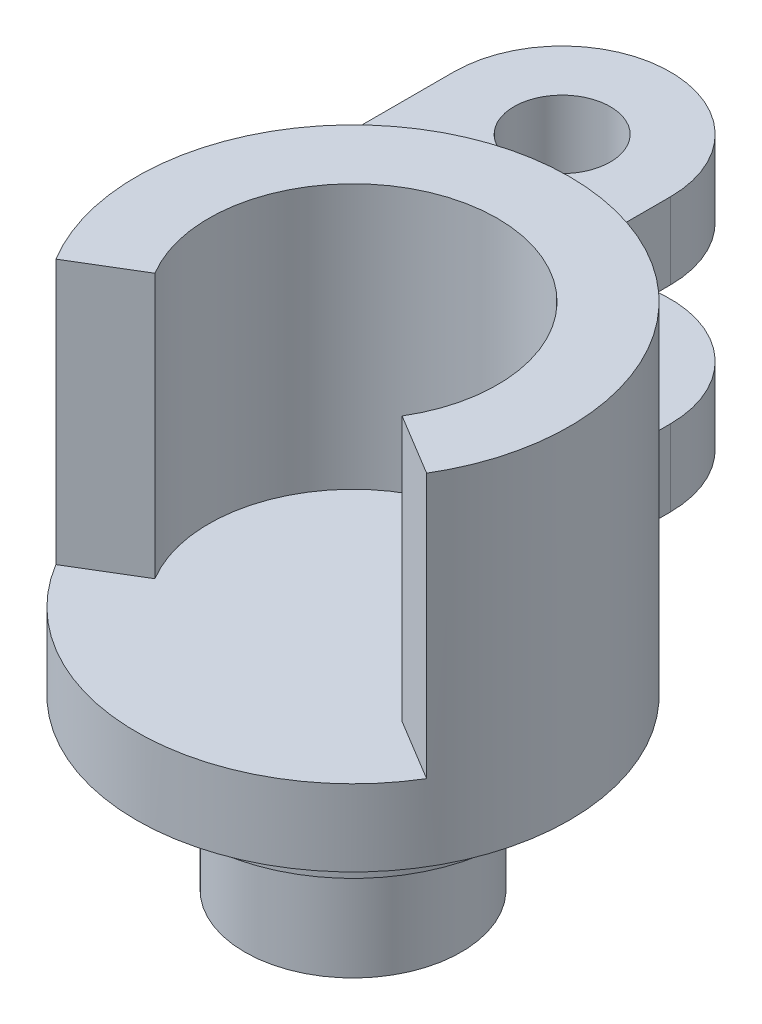
ISO-10303-21;
HEADER;
FILE_DESCRIPTION(('STEP AP214'),'2;1');
FILE_NAME('part.step','',(''),(''),'','','');
FILE_SCHEMA(('AUTOMOTIVE_DESIGN { 1 0 10303 214 1 1 1 1 }'));
ENDSEC;
DATA;
#1=APPLICATION_CONTEXT('core data for automotive mechanical design processes');
#2=APPLICATION_PROTOCOL_DEFINITION('international standard','automotive_design',2000,#1);
#3=PRODUCT_CONTEXT('',#1,'mechanical');
#4=PRODUCT('Part','Part','',(#3));
#5=PRODUCT_RELATED_PRODUCT_CATEGORY('part','',(#4));
#6=PRODUCT_DEFINITION_FORMATION('','',#4);
#7=PRODUCT_DEFINITION_CONTEXT('part definition',#1,'design');
#8=PRODUCT_DEFINITION('design','',#6,#7);
#9=PRODUCT_DEFINITION_SHAPE('','',#8);
#10=(LENGTH_UNIT() NAMED_UNIT(*) SI_UNIT(.MILLI.,.METRE.));
#11=(NAMED_UNIT(*) PLANE_ANGLE_UNIT() SI_UNIT($,.RADIAN.));
#12=(NAMED_UNIT(*) SI_UNIT($,.STERADIAN.) SOLID_ANGLE_UNIT());
#13=UNCERTAINTY_MEASURE_WITH_UNIT(LENGTH_MEASURE(1.E-05),#10,'distance_accuracy_value','');
#14=(GEOMETRIC_REPRESENTATION_CONTEXT(3) GLOBAL_UNCERTAINTY_ASSIGNED_CONTEXT((#13)) GLOBAL_UNIT_ASSIGNED_CONTEXT((#10,
#11,#12)) REPRESENTATION_CONTEXT('',''));
#15=CARTESIAN_POINT('',(0.,0.,0.));
#16=DIRECTION('',(0.,0.,1.));
#17=DIRECTION('',(1.,0.,0.));
#18=AXIS2_PLACEMENT_3D('',#15,#16,#17);
#19=CARTESIAN_POINT('',(0.,3.175,0.));
#20=DIRECTION('',(0.,-1.,0.));
#21=DIRECTION('',(0.,0.,-1.));
#22=AXIS2_PLACEMENT_3D('',#19,#20,#21);
#23=CYLINDRICAL_SURFACE('',#22,9.);
#24=DIRECTION('',(0.,-1.,0.));
#25=VECTOR('',#24,1.);
#26=CARTESIAN_POINT('',(0.,11.349999906,-9.));
#27=LINE('',#26,#25);
#28=CARTESIAN_POINT('',(0.,11.349999906,-9.));
#29=VERTEX_POINT('',#28);
#30=CARTESIAN_POINT('',(0.,8.174999906,-9.));
#31=VERTEX_POINT('',#30);
#32=EDGE_CURVE('E59',#29,#31,#27,.T.);
#33=ORIENTED_EDGE('',*,*,#32,.F.);
#34=CARTESIAN_POINT('',(0.,11.349999906,0.));
#35=DIRECTION('',(0.,-1.,0.));
#36=DIRECTION('',(0.,0.,1.));
#37=AXIS2_PLACEMENT_3D('',#34,#35,#36);
#38=CIRCLE('',#37,9.);
#39=CARTESIAN_POINT('',(-9.,11.349999906,0.));
#40=VERTEX_POINT('',#39);
#41=EDGE_CURVE('E64',#40,#29,#38,.T.);
#42=ORIENTED_EDGE('',*,*,#41,.F.);
#43=DIRECTION('',(0.,-1.,0.));
#44=VECTOR('',#43,1.);
#45=CARTESIAN_POINT('',(-9.,11.349999906,0.));
#46=LINE('',#45,#44);
#47=CARTESIAN_POINT('',(-9.,8.174999906,0.));
#48=VERTEX_POINT('',#47);
#49=EDGE_CURVE('E156',#40,#48,#46,.T.);
#50=ORIENTED_EDGE('',*,*,#49,.T.);
#51=CARTESIAN_POINT('',(0.,8.174999906,0.));
#52=DIRECTION('',(0.,-1.,0.));
#53=DIRECTION('',(0.,0.,1.));
#54=AXIS2_PLACEMENT_3D('',#51,#52,#53);
#55=CIRCLE('',#54,9.);
#56=EDGE_CURVE('E160',#48,#31,#55,.T.);
#57=ORIENTED_EDGE('',*,*,#56,.T.);
#58=EDGE_LOOP('',(#33,#42,#50,#57));
#59=FACE_BOUND('',#58,.T.);
#60=CARTESIAN_POINT('',(0.,3.175,0.));
#61=DIRECTION('',(0.,1.,0.));
#62=DIRECTION('',(0.,0.,1.));
#63=AXIS2_PLACEMENT_3D('',#60,#61,#62);
#64=CIRCLE('',#63,9.);
#65=CARTESIAN_POINT('',(-7.70770438364841,3.175,4.64664321142554));
#66=VERTEX_POINT('',#65);
#67=CARTESIAN_POINT('',(7.70770438364841,3.175,4.64664321142554));
#68=VERTEX_POINT('',#67);
#69=EDGE_CURVE('E233',#66,#68,#64,.T.);
#70=ORIENTED_EDGE('',*,*,#69,.F.);
#71=DIRECTION('',(0.,-1.,0.));
#72=VECTOR('',#71,1.);
#73=CARTESIAN_POINT('',(-7.70770438364841,14.175,4.64664321142554));
#74=LINE('',#73,#72);
#75=CARTESIAN_POINT('',(-7.70770438364841,14.175,4.64664321142554));
#76=VERTEX_POINT('',#75);
#77=EDGE_CURVE('E270',#76,#66,#74,.T.);
#78=ORIENTED_EDGE('',*,*,#77,.F.);
#79=CARTESIAN_POINT('',(0.,14.175,0.));
#80=DIRECTION('',(0.,1.,0.));
#81=DIRECTION('',(0.,0.,-1.));
#82=AXIS2_PLACEMENT_3D('',#79,#80,#81);
#83=CIRCLE('',#82,9.);
#84=CARTESIAN_POINT('',(7.70770438364841,14.175,4.64664321142554));
#85=VERTEX_POINT('',#84);
#86=EDGE_CURVE('E234',#85,#76,#83,.T.);
#87=ORIENTED_EDGE('',*,*,#86,.F.);
#88=DIRECTION('',(0.,-1.,0.));
#89=VECTOR('',#88,1.);
#90=CARTESIAN_POINT('',(7.70770438364841,14.175,4.64664321142554));
#91=LINE('',#90,#89);
#92=EDGE_CURVE('E248',#85,#68,#91,.T.);
#93=ORIENTED_EDGE('',*,*,#92,.T.);
#94=EDGE_LOOP('',(#70,#78,#87,#93));
#95=FACE_BOUND('',#94,.T.);
#96=DIRECTION('',(0.,-1.,0.));
#97=VECTOR('',#96,1.);
#98=CARTESIAN_POINT('',(0.,23.0265647372949,-9.));
#99=LINE('',#98,#97);
#100=CARTESIAN_POINT('',(0.,3.175,-9.));
#101=VERTEX_POINT('',#100);
#102=CARTESIAN_POINT('',(0.,0.,-9.));
#103=VERTEX_POINT('',#102);
#104=EDGE_CURVE('E195',#101,#103,#99,.T.);
#105=ORIENTED_EDGE('',*,*,#104,.F.);
#106=CARTESIAN_POINT('',(0.,3.175,0.));
#107=DIRECTION('',(0.,1.,0.));
#108=DIRECTION('',(0.,0.,1.));
#109=AXIS2_PLACEMENT_3D('',#106,#107,#108);
#110=CIRCLE('',#109,9.);
#111=CARTESIAN_POINT('',(-9.,3.175,0.));
#112=VERTEX_POINT('',#111);
#113=EDGE_CURVE('E205',#112,#101,#110,.F.);
#114=ORIENTED_EDGE('',*,*,#113,.F.);
#115=DIRECTION('',(0.,-1.,0.));
#116=VECTOR('',#115,1.);
#117=CARTESIAN_POINT('',(-9.,23.0265647372949,0.));
#118=LINE('',#117,#116);
#119=CARTESIAN_POINT('',(-9.,0.,0.));
#120=VERTEX_POINT('',#119);
#121=EDGE_CURVE('E179',#112,#120,#118,.T.);
#122=ORIENTED_EDGE('',*,*,#121,.T.);
#123=CARTESIAN_POINT('',(0.,0.,0.));
#124=DIRECTION('',(0.,1.,0.));
#125=DIRECTION('',(0.,0.,1.));
#126=AXIS2_PLACEMENT_3D('',#123,#124,#125);
#127=CIRCLE('',#126,9.);
#128=EDGE_CURVE('E274',#120,#103,#127,.T.);
#129=ORIENTED_EDGE('',*,*,#128,.T.);
#130=EDGE_LOOP('',(#105,#114,#122,#129));
#131=FACE_BOUND('',#130,.T.);
#132=ADVANCED_FACE('F42',(#59,#95,#131),#23,.T.);
#133=CARTESIAN_POINT('',(0.,3.175,0.));
#134=DIRECTION('',(0.,1.,0.));
#135=DIRECTION('',(0.,0.,1.));
#136=AXIS2_PLACEMENT_3D('',#133,#134,#135);
#137=PLANE('',#136);
#138=DIRECTION('',(0.856411598183157,0.,0.516293690158394));
#139=VECTOR('',#138,1.);
#140=CARTESIAN_POINT('',(5.13846958909894,3.175,3.09776214095036));
#141=LINE('',#140,#139);
#142=CARTESIAN_POINT('',(5.13846958909894,3.175,3.09776214095036));
#143=VERTEX_POINT('',#142);
#144=EDGE_CURVE('E239',#143,#68,#141,.T.);
#145=ORIENTED_EDGE('',*,*,#144,.F.);
#146=CARTESIAN_POINT('',(0.,3.175,0.));
#147=DIRECTION('',(0.,-1.,0.));
#148=DIRECTION('',(0.,0.,-1.));
#149=AXIS2_PLACEMENT_3D('',#146,#147,#148);
#150=CIRCLE('',#149,6.);
#151=CARTESIAN_POINT('',(-5.13846958909894,3.175,3.09776214095036));
#152=VERTEX_POINT('',#151);
#153=EDGE_CURVE('E252',#152,#143,#150,.T.);
#154=ORIENTED_EDGE('',*,*,#153,.F.);
#155=DIRECTION('',(0.856411598183157,0.,-0.516293690158393));
#156=VECTOR('',#155,1.);
#157=CARTESIAN_POINT('',(-7.70770438364841,3.175,4.64664321142554));
#158=LINE('',#157,#156);
#159=EDGE_CURVE('E229',#66,#152,#158,.T.);
#160=ORIENTED_EDGE('',*,*,#159,.F.);
#161=ORIENTED_EDGE('',*,*,#69,.T.);
#162=EDGE_LOOP('',(#145,#154,#160,#161));
#163=FACE_BOUND('',#162,.T.);
#164=ADVANCED_FACE('F307',(#163),#137,.T.);
#165=CARTESIAN_POINT('',(0.,0.,0.));
#166=DIRECTION('',(0.,1.,0.));
#167=DIRECTION('',(0.,0.,1.));
#168=AXIS2_PLACEMENT_3D('',#165,#166,#167);
#169=PLANE('',#168);
#170=CARTESIAN_POINT('',(-4.5,0.,-13.1941974251168));
#171=DIRECTION('',(0.,1.,0.));
#172=DIRECTION('',(0.,0.,1.));
#173=AXIS2_PLACEMENT_3D('',#170,#171,#172);
#174=CIRCLE('',#173,2.);
#175=CARTESIAN_POINT('',(-4.5,0.,-11.1941974251168));
#176=VERTEX_POINT('',#175);
#177=EDGE_CURVE('E348',#176,#176,#174,.F.);
#178=ORIENTED_EDGE('',*,*,#177,.F.);
#179=EDGE_LOOP('',(#178));
#180=FACE_BOUND('',#179,.T.);
#181=CARTESIAN_POINT('',(0.,0.,0.));
#182=DIRECTION('',(0.,-1.,0.));
#183=DIRECTION('',(0.,0.,-1.));
#184=AXIS2_PLACEMENT_3D('',#181,#182,#183);
#185=CIRCLE('',#184,6.5);
#186=CARTESIAN_POINT('',(0.,0.,-6.5));
#187=VERTEX_POINT('',#186);
#188=EDGE_CURVE('E51',#187,#187,#185,.T.);
#189=ORIENTED_EDGE('',*,*,#188,.F.);
#190=EDGE_LOOP('',(#189));
#191=FACE_BOUND('',#190,.T.);
#192=ORIENTED_EDGE('',*,*,#128,.F.);
#193=DIRECTION('',(0.,0.,1.));
#194=VECTOR('',#193,1.);
#195=CARTESIAN_POINT('',(-9.,0.,0.));
#196=LINE('',#195,#194);
#197=CARTESIAN_POINT('',(-9.,0.,-13.1941974251168));
#198=VERTEX_POINT('',#197);
#199=EDGE_CURVE('E180',#198,#120,#196,.T.);
#200=ORIENTED_EDGE('',*,*,#199,.F.);
#201=CARTESIAN_POINT('',(-4.5,0.,-13.1941974251168));
#202=DIRECTION('',(0.,1.,0.));
#203=DIRECTION('',(0.,0.,1.));
#204=AXIS2_PLACEMENT_3D('',#201,#202,#203);
#205=CIRCLE('',#204,4.5);
#206=CARTESIAN_POINT('',(0.,0.,-13.1941974251168));
#207=VERTEX_POINT('',#206);
#208=EDGE_CURVE('E186',#207,#198,#205,.T.);
#209=ORIENTED_EDGE('',*,*,#208,.F.);
#210=DIRECTION('',(0.,0.,-1.));
#211=VECTOR('',#210,1.);
#212=CARTESIAN_POINT('',(0.,0.,-9.));
#213=LINE('',#212,#211);
#214=EDGE_CURVE('E191',#103,#207,#213,.T.);
#215=ORIENTED_EDGE('',*,*,#214,.F.);
#216=EDGE_LOOP('',(#192,#200,#209,#215));
#217=FACE_BOUND('',#216,.T.);
#218=ADVANCED_FACE('F287',(#180,#191,#217),#169,.F.);
#219=CARTESIAN_POINT('',(-7.70770438364841,14.175,4.64664321142554));
#220=DIRECTION('',(-0.516293690158393,0.,-0.856411598183157));
#221=DIRECTION('',(-0.856411598183157,0.,0.516293690158393));
#222=AXIS2_PLACEMENT_3D('',#219,#220,#221);
#223=PLANE('',#222);
#224=ORIENTED_EDGE('',*,*,#159,.T.);
#225=DIRECTION('',(0.,-1.,0.));
#226=VECTOR('',#225,1.);
#227=CARTESIAN_POINT('',(-5.13846958909894,14.175,3.09776214095036));
#228=LINE('',#227,#226);
#229=CARTESIAN_POINT('',(-5.13846958909894,14.175,3.09776214095036));
#230=VERTEX_POINT('',#229);
#231=EDGE_CURVE('E266',#230,#152,#228,.T.);
#232=ORIENTED_EDGE('',*,*,#231,.F.);
#233=DIRECTION('',(0.856411598183157,0.,-0.516293690158393));
#234=VECTOR('',#233,1.);
#235=CARTESIAN_POINT('',(-7.70770438364841,14.175,4.64664321142554));
#236=LINE('',#235,#234);
#237=EDGE_CURVE('E238',#76,#230,#236,.T.);
#238=ORIENTED_EDGE('',*,*,#237,.F.);
#239=ORIENTED_EDGE('',*,*,#77,.T.);
#240=EDGE_LOOP('',(#224,#232,#238,#239));
#241=FACE_BOUND('',#240,.T.);
#242=ADVANCED_FACE('F320',(#241),#223,.F.);
#243=CARTESIAN_POINT('',(0.,14.175,0.));
#244=DIRECTION('',(0.,-1.,0.));
#245=DIRECTION('',(0.,0.,-1.));
#246=AXIS2_PLACEMENT_3D('',#243,#244,#245);
#247=CYLINDRICAL_SURFACE('',#246,6.);
#248=ORIENTED_EDGE('',*,*,#153,.T.);
#249=DIRECTION('',(0.,-1.,0.));
#250=VECTOR('',#249,1.);
#251=CARTESIAN_POINT('',(5.13846958909894,14.175,3.09776214095036));
#252=LINE('',#251,#250);
#253=CARTESIAN_POINT('',(5.13846958909894,14.175,3.09776214095036));
#254=VERTEX_POINT('',#253);
#255=EDGE_CURVE('E262',#254,#143,#252,.T.);
#256=ORIENTED_EDGE('',*,*,#255,.F.);
#257=CARTESIAN_POINT('',(0.,14.175,0.));
#258=DIRECTION('',(0.,-1.,0.));
#259=DIRECTION('',(0.,0.,-1.));
#260=AXIS2_PLACEMENT_3D('',#257,#258,#259);
#261=CIRCLE('',#260,6.);
#262=EDGE_CURVE('E242',#230,#254,#261,.T.);
#263=ORIENTED_EDGE('',*,*,#262,.F.);
#264=ORIENTED_EDGE('',*,*,#231,.T.);
#265=EDGE_LOOP('',(#248,#256,#263,#264));
#266=FACE_BOUND('',#265,.T.);
#267=ADVANCED_FACE('F330',(#266),#247,.F.);
#268=CARTESIAN_POINT('',(5.13846958909894,14.175,3.09776214095036));
#269=DIRECTION('',(0.516293690158394,0.,-0.856411598183157));
#270=DIRECTION('',(-0.856411598183157,0.,-0.516293690158394));
#271=AXIS2_PLACEMENT_3D('',#268,#269,#270);
#272=PLANE('',#271);
#273=ORIENTED_EDGE('',*,*,#144,.T.);
#274=ORIENTED_EDGE('',*,*,#92,.F.);
#275=DIRECTION('',(0.856411598183157,0.,0.516293690158394));
#276=VECTOR('',#275,1.);
#277=CARTESIAN_POINT('',(5.13846958909894,14.175,3.09776214095036));
#278=LINE('',#277,#276);
#279=EDGE_CURVE('E245',#254,#85,#278,.T.);
#280=ORIENTED_EDGE('',*,*,#279,.F.);
#281=ORIENTED_EDGE('',*,*,#255,.T.);
#282=EDGE_LOOP('',(#273,#274,#280,#281));
#283=FACE_BOUND('',#282,.T.);
#284=ADVANCED_FACE('F328',(#283),#272,.F.);
#285=CARTESIAN_POINT('',(0.,14.175,0.));
#286=DIRECTION('',(0.,-1.,0.));
#287=DIRECTION('',(0.,0.,-1.));
#288=AXIS2_PLACEMENT_3D('',#285,#286,#287);
#289=PLANE('',#288);
#290=ORIENTED_EDGE('',*,*,#86,.T.);
#291=ORIENTED_EDGE('',*,*,#237,.T.);
#292=ORIENTED_EDGE('',*,*,#262,.T.);
#293=ORIENTED_EDGE('',*,*,#279,.T.);
#294=EDGE_LOOP('',(#290,#291,#292,#293));
#295=FACE_BOUND('',#294,.T.);
#296=ADVANCED_FACE('F324',(#295),#289,.F.);
#297=CARTESIAN_POINT('',(0.,-2.,0.));
#298=DIRECTION('',(0.,1.,0.));
#299=DIRECTION('',(0.,0.,1.));
#300=AXIS2_PLACEMENT_3D('',#297,#298,#299);
#301=CYLINDRICAL_SURFACE('',#300,6.5);
#302=CARTESIAN_POINT('',(0.,-2.,0.));
#303=DIRECTION('',(0.,-1.,0.));
#304=DIRECTION('',(0.,0.,-1.));
#305=AXIS2_PLACEMENT_3D('',#302,#303,#304);
#306=CIRCLE('',#305,6.5);
#307=CARTESIAN_POINT('',(0.,-2.,-6.5));
#308=VERTEX_POINT('',#307);
#309=EDGE_CURVE('E224',#308,#308,#306,.T.);
#310=ORIENTED_EDGE('',*,*,#309,.F.);
#311=EDGE_LOOP('',(#310));
#312=FACE_BOUND('',#311,.T.);
#313=ORIENTED_EDGE('',*,*,#188,.T.);
#314=EDGE_LOOP('',(#313));
#315=FACE_BOUND('',#314,.T.);
#316=ADVANCED_FACE('F351',(#312,#315),#301,.T.);
#317=CARTESIAN_POINT('',(0.,-2.,0.));
#318=DIRECTION('',(0.,-1.,0.));
#319=DIRECTION('',(0.,0.,-1.));
#320=AXIS2_PLACEMENT_3D('',#317,#318,#319);
#321=PLANE('',#320);
#322=CARTESIAN_POINT('',(0.,-2.,0.));
#323=DIRECTION('',(0.,-1.,0.));
#324=DIRECTION('',(0.,0.,-1.));
#325=AXIS2_PLACEMENT_3D('',#322,#323,#324);
#326=CIRCLE('',#325,4.5);
#327=CARTESIAN_POINT('',(0.,-2.,-4.5));
#328=VERTEX_POINT('',#327);
#329=EDGE_CURVE('E11',#328,#328,#326,.T.);
#330=ORIENTED_EDGE('',*,*,#329,.F.);
#331=EDGE_LOOP('',(#330));
#332=FACE_BOUND('',#331,.T.);
#333=ORIENTED_EDGE('',*,*,#309,.T.);
#334=EDGE_LOOP('',(#333));
#335=FACE_BOUND('',#334,.T.);
#336=ADVANCED_FACE('F353',(#332,#335),#321,.T.);
#337=CARTESIAN_POINT('',(0.,-7.,0.));
#338=DIRECTION('',(0.,1.,0.));
#339=DIRECTION('',(0.,0.,1.));
#340=AXIS2_PLACEMENT_3D('',#337,#338,#339);
#341=CYLINDRICAL_SURFACE('',#340,4.5);
#342=CARTESIAN_POINT('',(0.,-7.,0.));
#343=DIRECTION('',(0.,-1.,0.));
#344=DIRECTION('',(0.,0.,-1.));
#345=AXIS2_PLACEMENT_3D('',#342,#343,#344);
#346=CIRCLE('',#345,4.5);
#347=CARTESIAN_POINT('',(0.,-7.,-4.5));
#348=VERTEX_POINT('',#347);
#349=EDGE_CURVE('E200',#348,#348,#346,.T.);
#350=ORIENTED_EDGE('',*,*,#349,.F.);
#351=EDGE_LOOP('',(#350));
#352=FACE_BOUND('',#351,.T.);
#353=ORIENTED_EDGE('',*,*,#329,.T.);
#354=EDGE_LOOP('',(#353));
#355=FACE_BOUND('',#354,.T.);
#356=ADVANCED_FACE('F360',(#352,#355),#341,.T.);
#357=CARTESIAN_POINT('',(0.,-7.,0.));
#358=DIRECTION('',(0.,-1.,0.));
#359=DIRECTION('',(0.,0.,-1.));
#360=AXIS2_PLACEMENT_3D('',#357,#358,#359);
#361=PLANE('',#360);
#362=ORIENTED_EDGE('',*,*,#349,.T.);
#363=EDGE_LOOP('',(#362));
#364=FACE_BOUND('',#363,.T.);
#365=ADVANCED_FACE('F367',(#364),#361,.T.);
#366=CARTESIAN_POINT('',(0.,23.0265647372949,-9.));
#367=DIRECTION('',(-1.,0.,0.));
#368=DIRECTION('',(0.,0.,1.));
#369=AXIS2_PLACEMENT_3D('',#366,#367,#368);
#370=PLANE('',#369);
#371=DIRECTION('',(0.,0.,-1.));
#372=VECTOR('',#371,1.);
#373=CARTESIAN_POINT('',(0.,3.175,-9.));
#374=LINE('',#373,#372);
#375=CARTESIAN_POINT('',(0.,3.175,-13.1941974251168));
#376=VERTEX_POINT('',#375);
#377=EDGE_CURVE('E201',#101,#376,#374,.T.);
#378=ORIENTED_EDGE('',*,*,#377,.F.);
#379=ORIENTED_EDGE('',*,*,#104,.T.);
#380=ORIENTED_EDGE('',*,*,#214,.T.);
#381=DIRECTION('',(0.,-1.,0.));
#382=VECTOR('',#381,1.);
#383=CARTESIAN_POINT('',(0.,23.0265647372949,-13.1941974251168));
#384=LINE('',#383,#382);
#385=EDGE_CURVE('E190',#376,#207,#384,.T.);
#386=ORIENTED_EDGE('',*,*,#385,.F.);
#387=EDGE_LOOP('',(#378,#379,#380,#386));
#388=FACE_BOUND('',#387,.T.);
#389=ADVANCED_FACE('F284',(#388),#370,.F.);
#390=CARTESIAN_POINT('',(-4.5,23.0265647372949,-13.1941974251168));
#391=DIRECTION('',(0.,-1.,0.));
#392=DIRECTION('',(0.,0.,-1.));
#393=AXIS2_PLACEMENT_3D('',#390,#391,#392);
#394=CYLINDRICAL_SURFACE('',#393,4.5);
#395=CARTESIAN_POINT('',(-4.5,3.175,-13.1941974251168));
#396=DIRECTION('',(0.,1.,0.));
#397=DIRECTION('',(0.,0.,1.));
#398=AXIS2_PLACEMENT_3D('',#395,#396,#397);
#399=CIRCLE('',#398,4.5);
#400=CARTESIAN_POINT('',(-9.,3.175,-13.1941974251168));
#401=VERTEX_POINT('',#400);
#402=EDGE_CURVE('E196',#376,#401,#399,.T.);
#403=ORIENTED_EDGE('',*,*,#402,.F.);
#404=ORIENTED_EDGE('',*,*,#385,.T.);
#405=ORIENTED_EDGE('',*,*,#208,.T.);
#406=DIRECTION('',(0.,-1.,0.));
#407=VECTOR('',#406,1.);
#408=CARTESIAN_POINT('',(-9.,23.0265647372949,-13.1941974251168));
#409=LINE('',#408,#407);
#410=EDGE_CURVE('E185',#401,#198,#409,.T.);
#411=ORIENTED_EDGE('',*,*,#410,.F.);
#412=EDGE_LOOP('',(#403,#404,#405,#411));
#413=FACE_BOUND('',#412,.T.);
#414=ADVANCED_FACE('F289',(#413),#394,.T.);
#415=CARTESIAN_POINT('',(-9.,23.0265647372949,0.));
#416=DIRECTION('',(1.,0.,0.));
#417=DIRECTION('',(0.,0.,-1.));
#418=AXIS2_PLACEMENT_3D('',#415,#416,#417);
#419=PLANE('',#418);
#420=DIRECTION('',(0.,0.,1.));
#421=VECTOR('',#420,1.);
#422=CARTESIAN_POINT('',(-9.,3.175,0.));
#423=LINE('',#422,#421);
#424=EDGE_CURVE('E184',#401,#112,#423,.T.);
#425=ORIENTED_EDGE('',*,*,#424,.F.);
#426=ORIENTED_EDGE('',*,*,#410,.T.);
#427=ORIENTED_EDGE('',*,*,#199,.T.);
#428=ORIENTED_EDGE('',*,*,#121,.F.);
#429=EDGE_LOOP('',(#425,#426,#427,#428));
#430=FACE_BOUND('',#429,.T.);
#431=ADVANCED_FACE('F294',(#430),#419,.F.);
#432=CARTESIAN_POINT('',(0.,3.175,0.));
#433=DIRECTION('',(0.,1.,0.));
#434=DIRECTION('',(0.,0.,1.));
#435=AXIS2_PLACEMENT_3D('',#432,#433,#434);
#436=PLANE('',#435);
#437=CARTESIAN_POINT('',(-4.5,3.175,-13.1941974251168));
#438=DIRECTION('',(0.,1.,0.));
#439=DIRECTION('',(0.,0.,1.));
#440=AXIS2_PLACEMENT_3D('',#437,#438,#439);
#441=CIRCLE('',#440,2.);
#442=CARTESIAN_POINT('',(-4.5,3.175,-11.1941974251168));
#443=VERTEX_POINT('',#442);
#444=EDGE_CURVE('E163',#443,#443,#441,.T.);
#445=ORIENTED_EDGE('',*,*,#444,.F.);
#446=EDGE_LOOP('',(#445));
#447=FACE_BOUND('',#446,.T.);
#448=ORIENTED_EDGE('',*,*,#424,.T.);
#449=ORIENTED_EDGE('',*,*,#113,.T.);
#450=ORIENTED_EDGE('',*,*,#377,.T.);
#451=ORIENTED_EDGE('',*,*,#402,.T.);
#452=EDGE_LOOP('',(#448,#449,#450,#451));
#453=FACE_BOUND('',#452,.T.);
#454=ADVANCED_FACE('F292',(#447,#453),#436,.T.);
#455=CARTESIAN_POINT('',(0.,11.349999906,-9.));
#456=DIRECTION('',(-1.,0.,0.));
#457=DIRECTION('',(0.,0.,1.));
#458=AXIS2_PLACEMENT_3D('',#455,#456,#457);
#459=PLANE('',#458);
#460=DIRECTION('',(0.,0.,-1.));
#461=VECTOR('',#460,1.);
#462=CARTESIAN_POINT('',(0.,8.174999906,-9.));
#463=LINE('',#462,#461);
#464=CARTESIAN_POINT('',(0.,8.174999906,-13.1941974251168));
#465=VERTEX_POINT('',#464);
#466=EDGE_CURVE('E143',#31,#465,#463,.T.);
#467=ORIENTED_EDGE('',*,*,#466,.T.);
#468=DIRECTION('',(0.,-1.,0.));
#469=VECTOR('',#468,1.);
#470=CARTESIAN_POINT('',(0.,11.349999906,-13.1941974251168));
#471=LINE('',#470,#469);
#472=CARTESIAN_POINT('',(0.,11.349999906,-13.1941974251168));
#473=VERTEX_POINT('',#472);
#474=EDGE_CURVE('E140',#473,#465,#471,.T.);
#475=ORIENTED_EDGE('',*,*,#474,.F.);
#476=DIRECTION('',(0.,0.,-1.));
#477=VECTOR('',#476,1.);
#478=CARTESIAN_POINT('',(0.,11.349999906,-9.));
#479=LINE('',#478,#477);
#480=EDGE_CURVE('E130',#29,#473,#479,.T.);
#481=ORIENTED_EDGE('',*,*,#480,.F.);
#482=ORIENTED_EDGE('',*,*,#32,.T.);
#483=EDGE_LOOP('',(#467,#475,#481,#482));
#484=FACE_BOUND('',#483,.T.);
#485=ADVANCED_FACE('F141',(#484),#459,.F.);
#486=CARTESIAN_POINT('',(-4.5,11.349999906,-13.1941974251168));
#487=DIRECTION('',(0.,-1.,0.));
#488=DIRECTION('',(0.,0.,-1.));
#489=AXIS2_PLACEMENT_3D('',#486,#487,#488);
#490=CYLINDRICAL_SURFACE('',#489,4.5);
#491=CARTESIAN_POINT('',(-4.5,8.174999906,-13.1941974251168));
#492=DIRECTION('',(0.,1.,0.));
#493=DIRECTION('',(0.,0.,1.));
#494=AXIS2_PLACEMENT_3D('',#491,#492,#493);
#495=CIRCLE('',#494,4.5);
#496=CARTESIAN_POINT('',(-9.,8.174999906,-13.1941974251168));
#497=VERTEX_POINT('',#496);
#498=EDGE_CURVE('E166',#465,#497,#495,.T.);
#499=ORIENTED_EDGE('',*,*,#498,.T.);
#500=DIRECTION('',(0.,-1.,0.));
#501=VECTOR('',#500,1.);
#502=CARTESIAN_POINT('',(-9.,11.349999906,-13.1941974251168));
#503=LINE('',#502,#501);
#504=CARTESIAN_POINT('',(-9.,11.349999906,-13.1941974251168));
#505=VERTEX_POINT('',#504);
#506=EDGE_CURVE('E147',#505,#497,#503,.T.);
#507=ORIENTED_EDGE('',*,*,#506,.F.);
#508=CARTESIAN_POINT('',(-4.5,11.349999906,-13.1941974251168));
#509=DIRECTION('',(0.,1.,0.));
#510=DIRECTION('',(0.,0.,1.));
#511=AXIS2_PLACEMENT_3D('',#508,#509,#510);
#512=CIRCLE('',#511,4.5);
#513=EDGE_CURVE('E134',#473,#505,#512,.T.);
#514=ORIENTED_EDGE('',*,*,#513,.F.);
#515=ORIENTED_EDGE('',*,*,#474,.T.);
#516=EDGE_LOOP('',(#499,#507,#514,#515));
#517=FACE_BOUND('',#516,.T.);
#518=ADVANCED_FACE('F149',(#517),#490,.T.);
#519=CARTESIAN_POINT('',(-9.,11.349999906,-13.1941974251168));
#520=DIRECTION('',(1.,0.,0.));
#521=DIRECTION('',(0.,0.,-1.));
#522=AXIS2_PLACEMENT_3D('',#519,#520,#521);
#523=PLANE('',#522);
#524=DIRECTION('',(0.,0.,1.));
#525=VECTOR('',#524,1.);
#526=CARTESIAN_POINT('',(-9.,8.174999906,-13.1941974251168));
#527=LINE('',#526,#525);
#528=EDGE_CURVE('E169',#497,#48,#527,.T.);
#529=ORIENTED_EDGE('',*,*,#528,.T.);
#530=ORIENTED_EDGE('',*,*,#49,.F.);
#531=DIRECTION('',(0.,0.,1.));
#532=VECTOR('',#531,1.);
#533=CARTESIAN_POINT('',(-9.,11.349999906,-13.1941974251168));
#534=LINE('',#533,#532);
#535=EDGE_CURVE('E153',#505,#40,#534,.T.);
#536=ORIENTED_EDGE('',*,*,#535,.F.);
#537=ORIENTED_EDGE('',*,*,#506,.T.);
#538=EDGE_LOOP('',(#529,#530,#536,#537));
#539=FACE_BOUND('',#538,.T.);
#540=ADVANCED_FACE('F414',(#539),#523,.F.);
#541=CARTESIAN_POINT('',(0.,11.349999906,0.));
#542=DIRECTION('',(0.,1.,0.));
#543=DIRECTION('',(0.,0.,1.));
#544=AXIS2_PLACEMENT_3D('',#541,#542,#543);
#545=PLANE('',#544);
#546=CARTESIAN_POINT('',(-4.5,11.349999906,-13.1941974251168));
#547=DIRECTION('',(0.,1.,0.));
#548=DIRECTION('',(0.,0.,1.));
#549=AXIS2_PLACEMENT_3D('',#546,#547,#548);
#550=CIRCLE('',#549,2.);
#551=CARTESIAN_POINT('',(-4.5,11.349999906,-11.1941974251168));
#552=VERTEX_POINT('',#551);
#553=EDGE_CURVE('E474',#552,#552,#550,.T.);
#554=ORIENTED_EDGE('',*,*,#553,.F.);
#555=EDGE_LOOP('',(#554));
#556=FACE_BOUND('',#555,.T.);
#557=ORIENTED_EDGE('',*,*,#41,.T.);
#558=ORIENTED_EDGE('',*,*,#480,.T.);
#559=ORIENTED_EDGE('',*,*,#513,.T.);
#560=ORIENTED_EDGE('',*,*,#535,.T.);
#561=EDGE_LOOP('',(#557,#558,#559,#560));
#562=FACE_BOUND('',#561,.T.);
#563=ADVANCED_FACE('F132',(#556,#562),#545,.T.);
#564=CARTESIAN_POINT('',(0.,8.174999906,0.));
#565=DIRECTION('',(0.,1.,0.));
#566=DIRECTION('',(0.,0.,1.));
#567=AXIS2_PLACEMENT_3D('',#564,#565,#566);
#568=PLANE('',#567);
#569=CARTESIAN_POINT('',(-4.5,8.174999906,-13.1941974251168));
#570=DIRECTION('',(0.,1.,0.));
#571=DIRECTION('',(0.,0.,1.));
#572=AXIS2_PLACEMENT_3D('',#569,#570,#571);
#573=CIRCLE('',#572,2.);
#574=CARTESIAN_POINT('',(-4.5,8.174999906,-11.1941974251168));
#575=VERTEX_POINT('',#574);
#576=EDGE_CURVE('E45',#575,#575,#573,.T.);
#577=ORIENTED_EDGE('',*,*,#576,.T.);
#578=EDGE_LOOP('',(#577));
#579=FACE_BOUND('',#578,.T.);
#580=ORIENTED_EDGE('',*,*,#56,.F.);
#581=ORIENTED_EDGE('',*,*,#528,.F.);
#582=ORIENTED_EDGE('',*,*,#498,.F.);
#583=ORIENTED_EDGE('',*,*,#466,.F.);
#584=EDGE_LOOP('',(#580,#581,#582,#583));
#585=FACE_BOUND('',#584,.T.);
#586=ADVANCED_FACE('F433',(#579,#585),#568,.F.);
#587=CARTESIAN_POINT('',(-4.5,-5.65685424949238,-13.1941974251168));
#588=DIRECTION('',(0.,1.,0.));
#589=DIRECTION('',(0.,0.,1.));
#590=AXIS2_PLACEMENT_3D('',#587,#588,#589);
#591=CYLINDRICAL_SURFACE('',#590,2.);
#592=ORIENTED_EDGE('',*,*,#553,.T.);
#593=EDGE_LOOP('',(#592));
#594=FACE_BOUND('',#593,.T.);
#595=ORIENTED_EDGE('',*,*,#576,.F.);
#596=EDGE_LOOP('',(#595));
#597=FACE_BOUND('',#596,.T.);
#598=ADVANCED_FACE('F444',(#594,#597),#591,.F.);
#599=ORIENTED_EDGE('',*,*,#444,.T.);
#600=EDGE_LOOP('',(#599));
#601=FACE_BOUND('',#600,.T.);
#602=ORIENTED_EDGE('',*,*,#177,.T.);
#603=EDGE_LOOP('',(#602));
#604=FACE_BOUND('',#603,.T.);
#605=ADVANCED_FACE('F455',(#601,#604),#591,.F.);
#606=CLOSED_SHELL('',(#132,#164,#218,#242,#267,#284,#296,#316,#336,#356,#365,#389,#414,#431,
#454,#485,#518,#540,#563,#586,#598,#605));
#607=MANIFOLD_SOLID_BREP('B2',#606);
#608=ADVANCED_BREP_SHAPE_REPRESENTATION('',(#18,#607),#14);
#609=SHAPE_DEFINITION_REPRESENTATION(#9,#608);
ENDSEC;
END-ISO-10303-21;
